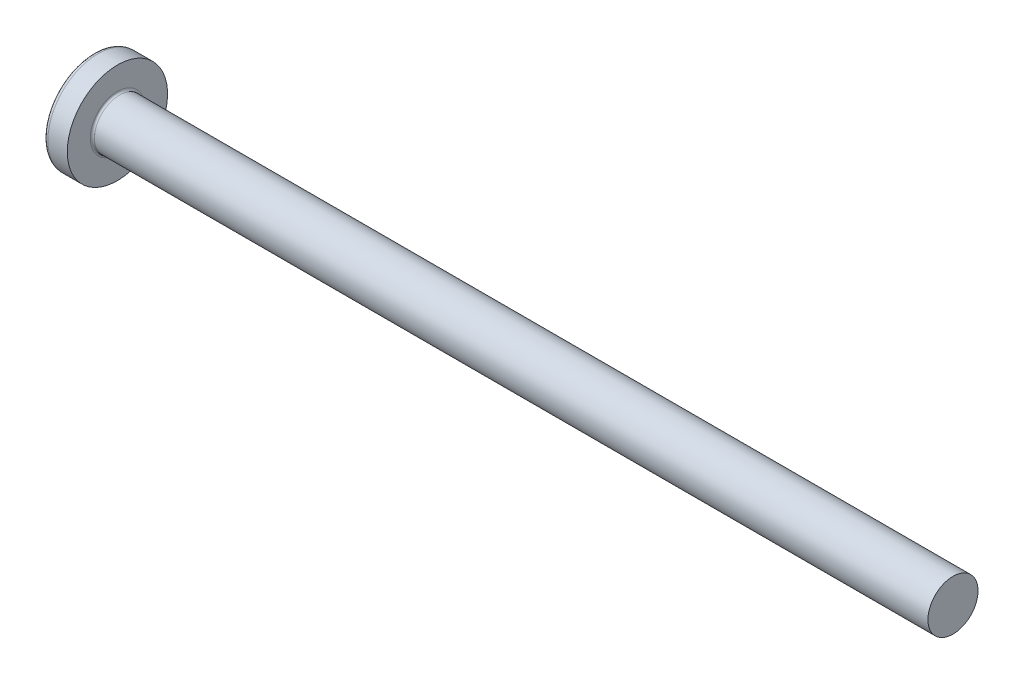
ISO-10303-21;
HEADER;
FILE_DESCRIPTION(('STEP AP214'),'2;1');
FILE_NAME('part.step','',(''),(''),'','','');
FILE_SCHEMA(('AUTOMOTIVE_DESIGN { 1 0 10303 214 1 1 1 1 }'));
ENDSEC;
DATA;
#1=APPLICATION_CONTEXT('core data for automotive mechanical design processes');
#2=APPLICATION_PROTOCOL_DEFINITION('international standard','automotive_design',2000,#1);
#3=PRODUCT_CONTEXT('',#1,'mechanical');
#4=PRODUCT('Part','Part','',(#3));
#5=PRODUCT_RELATED_PRODUCT_CATEGORY('part','',(#4));
#6=PRODUCT_DEFINITION_FORMATION('','',#4);
#7=PRODUCT_DEFINITION_CONTEXT('part definition',#1,'design');
#8=PRODUCT_DEFINITION('design','',#6,#7);
#9=PRODUCT_DEFINITION_SHAPE('','',#8);
#10=(LENGTH_UNIT() NAMED_UNIT(*) SI_UNIT(.MILLI.,.METRE.));
#11=(NAMED_UNIT(*) PLANE_ANGLE_UNIT() SI_UNIT($,.RADIAN.));
#12=(NAMED_UNIT(*) SI_UNIT($,.STERADIAN.) SOLID_ANGLE_UNIT());
#13=UNCERTAINTY_MEASURE_WITH_UNIT(LENGTH_MEASURE(1.E-05),#10,'distance_accuracy_value','');
#14=(GEOMETRIC_REPRESENTATION_CONTEXT(3) GLOBAL_UNCERTAINTY_ASSIGNED_CONTEXT((#13)) GLOBAL_UNIT_ASSIGNED_CONTEXT((#10,
#11,#12)) REPRESENTATION_CONTEXT('',''));
#15=CARTESIAN_POINT('',(0.,0.,0.));
#16=DIRECTION('',(0.,0.,1.));
#17=DIRECTION('',(1.,0.,0.));
#18=AXIS2_PLACEMENT_3D('',#15,#16,#17);
#19=CARTESIAN_POINT('',(10.,0.,0.));
#20=DIRECTION('',(-1.,0.,0.));
#21=DIRECTION('',(0.,1.,0.));
#22=AXIS2_PLACEMENT_3D('',#19,#20,#21);
#23=SPHERICAL_SURFACE('',#22,10.);
#24=CARTESIAN_POINT('',(1.83373872480847,0.,0.));
#25=DIRECTION('',(-1.,0.,0.));
#26=DIRECTION('',(0.,0.,1.));
#27=AXIS2_PLACEMENT_3D('',#24,#25,#26);
#28=CIRCLE('',#27,5.77167019027484);
#29=CARTESIAN_POINT('',(1.83373872480847,0.,5.77167019027484));
#30=VERTEX_POINT('',#29);
#31=EDGE_CURVE('E214',#30,#30,#28,.T.);
#32=ORIENTED_EDGE('',*,*,#31,.T.);
#33=EDGE_LOOP('',(#32));
#34=FACE_BOUND('',#33,.T.);
#35=CARTESIAN_POINT('',(0.11533271177369,0.,0.));
#36=DIRECTION('',(1.,0.,0.));
#37=DIRECTION('',(0.,0.,-1.));
#38=AXIS2_PLACEMENT_3D('',#35,#36,#37);
#39=CIRCLE('',#38,1.51438192047739);
#40=CARTESIAN_POINT('',(0.115332711773695,-0.709999999999995,-1.33762947076864));
#41=VERTEX_POINT('',#40);
#42=CARTESIAN_POINT('',(0.11533271177369,-1.33762947076862,-0.71));
#43=VERTEX_POINT('',#42);
#44=EDGE_CURVE('E341',#41,#43,#39,.F.);
#45=ORIENTED_EDGE('',*,*,#44,.F.);
#46=CARTESIAN_POINT('',(10.,-0.71,0.));
#47=DIRECTION('',(0.,1.,0.));
#48=DIRECTION('',(0.,0.,1.));
#49=AXIS2_PLACEMENT_3D('',#46,#47,#48);
#50=CIRCLE('',#49,9.97476315508293);
#51=CARTESIAN_POINT('',(0.516695966128057,-0.709999999999989,-3.09238493741451));
#52=VERTEX_POINT('',#51);
#53=EDGE_CURVE('E274',#52,#41,#50,.T.);
#54=ORIENTED_EDGE('',*,*,#53,.F.);
#55=CARTESIAN_POINT('',(9.3467899937754,0.,1.3101368059126));
#56=DIRECTION('',(0.446197753347436,0.,-0.894934391398443));
#57=DIRECTION('',(-0.894934391398443,0.,-0.446197753347436));
#58=AXIS2_PLACEMENT_3D('',#55,#56,#57);
#59=CIRCLE('',#58,9.89226254390578);
#60=CARTESIAN_POINT('',(0.516695966128057,0.710000000000011,-3.0923849374145));
#61=VERTEX_POINT('',#60);
#62=EDGE_CURVE('E248',#52,#61,#59,.T.);
#63=ORIENTED_EDGE('',*,*,#62,.T.);
#64=CARTESIAN_POINT('',(10.,0.71,0.));
#65=DIRECTION('',(0.,-1.,0.));
#66=DIRECTION('',(0.,0.,-1.));
#67=AXIS2_PLACEMENT_3D('',#64,#65,#66);
#68=CIRCLE('',#67,9.97476315508293);
#69=CARTESIAN_POINT('',(0.115332711773694,0.710000000000005,-1.33762947076863));
#70=VERTEX_POINT('',#69);
#71=EDGE_CURVE('E303',#70,#61,#68,.T.);
#72=ORIENTED_EDGE('',*,*,#71,.F.);
#73=CARTESIAN_POINT('',(0.11533271177369,1.33762947076862,-0.71));
#74=VERTEX_POINT('',#73);
#75=EDGE_CURVE('E356',#74,#70,#39,.F.);
#76=ORIENTED_EDGE('',*,*,#75,.F.);
#77=CARTESIAN_POINT('',(10.,0.,-0.71));
#78=DIRECTION('',(0.,0.,1.));
#79=DIRECTION('',(1.,0.,0.));
#80=AXIS2_PLACEMENT_3D('',#77,#78,#79);
#81=CIRCLE('',#80,9.97476315508293);
#82=CARTESIAN_POINT('',(0.516695966128057,3.09238493741451,-0.71));
#83=VERTEX_POINT('',#82);
#84=EDGE_CURVE('E242',#83,#74,#81,.T.);
#85=ORIENTED_EDGE('',*,*,#84,.F.);
#86=CARTESIAN_POINT('',(9.3467899937754,-1.3101368059126,0.));
#87=DIRECTION('',(0.446197753347436,0.894934391398443,0.));
#88=DIRECTION('',(-0.894934391398443,0.446197753347436,0.));
#89=AXIS2_PLACEMENT_3D('',#86,#87,#88);
#90=CIRCLE('',#89,9.89226254390578);
#91=CARTESIAN_POINT('',(0.516695966128057,3.09238493741451,0.71));
#92=VERTEX_POINT('',#91);
#93=EDGE_CURVE('E245',#83,#92,#90,.T.);
#94=ORIENTED_EDGE('',*,*,#93,.T.);
#95=CARTESIAN_POINT('',(10.,0.,0.71));
#96=DIRECTION('',(0.,0.,-1.));
#97=DIRECTION('',(0.,1.,0.));
#98=AXIS2_PLACEMENT_3D('',#95,#96,#97);
#99=CIRCLE('',#98,9.97476315508293);
#100=CARTESIAN_POINT('',(0.11533271177369,1.33762947076862,0.71));
#101=VERTEX_POINT('',#100);
#102=EDGE_CURVE('E238',#101,#92,#99,.T.);
#103=ORIENTED_EDGE('',*,*,#102,.F.);
#104=CARTESIAN_POINT('',(0.115332711773695,0.709999999999995,1.33762947076864));
#105=VERTEX_POINT('',#104);
#106=EDGE_CURVE('E355',#105,#101,#39,.F.);
#107=ORIENTED_EDGE('',*,*,#106,.F.);
#108=CARTESIAN_POINT('',(0.516695966128057,0.709999999999989,3.09238493741451));
#109=VERTEX_POINT('',#108);
#110=EDGE_CURVE('E258',#109,#105,#68,.T.);
#111=ORIENTED_EDGE('',*,*,#110,.F.);
#112=CARTESIAN_POINT('',(9.3467899937754,0.,-1.3101368059126));
#113=DIRECTION('',(0.446197753347436,0.,0.894934391398443));
#114=DIRECTION('',(0.894934391398443,0.,-0.446197753347436));
#115=AXIS2_PLACEMENT_3D('',#112,#113,#114);
#116=CIRCLE('',#115,9.89226254390578);
#117=CARTESIAN_POINT('',(0.516695966128057,-0.710000000000011,3.0923849374145));
#118=VERTEX_POINT('',#117);
#119=EDGE_CURVE('E49',#109,#118,#116,.T.);
#120=ORIENTED_EDGE('',*,*,#119,.T.);
#121=CARTESIAN_POINT('',(0.115332711773694,-0.710000000000005,1.33762947076863));
#122=VERTEX_POINT('',#121);
#123=EDGE_CURVE('E255',#122,#118,#50,.T.);
#124=ORIENTED_EDGE('',*,*,#123,.F.);
#125=CARTESIAN_POINT('',(0.11533271177369,-1.33762947076862,0.709999999999999));
#126=VERTEX_POINT('',#125);
#127=EDGE_CURVE('E391',#126,#122,#39,.F.);
#128=ORIENTED_EDGE('',*,*,#127,.F.);
#129=CARTESIAN_POINT('',(0.516695966128057,-3.0923849374145,0.709999999999999));
#130=VERTEX_POINT('',#129);
#131=EDGE_CURVE('E239',#130,#126,#99,.T.);
#132=ORIENTED_EDGE('',*,*,#131,.F.);
#133=CARTESIAN_POINT('',(9.3467899937754,1.3101368059126,0.));
#134=DIRECTION('',(0.446197753347436,-0.894934391398443,0.));
#135=DIRECTION('',(0.894934391398443,0.446197753347436,0.));
#136=AXIS2_PLACEMENT_3D('',#133,#134,#135);
#137=CIRCLE('',#136,9.89226254390578);
#138=CARTESIAN_POINT('',(0.516695966128057,-3.09238493741451,-0.71));
#139=VERTEX_POINT('',#138);
#140=EDGE_CURVE('E235',#130,#139,#137,.T.);
#141=ORIENTED_EDGE('',*,*,#140,.T.);
#142=EDGE_CURVE('E64',#43,#139,#81,.T.);
#143=ORIENTED_EDGE('',*,*,#142,.F.);
#144=EDGE_LOOP('',(#45,#54,#63,#72,#76,#85,#94,#103,#107,#111,#120,#124,#128,#132,#141,#143));
#145=FACE_BOUND('',#144,.T.);
#146=ADVANCED_FACE('F35',(#34,#145),#23,.T.);
#147=CARTESIAN_POINT('',(3.46,1.62490792462486,-0.71));
#148=DIRECTION('',(0.,0.,1.));
#149=DIRECTION('',(1.,0.,0.));
#150=AXIS2_PLACEMENT_3D('',#147,#148,#149);
#151=PLANE('',#150);
#152=ORIENTED_EDGE('',*,*,#84,.T.);
#153=CARTESIAN_POINT('',(-2.28089704213722,1.52473965101837,-0.71));
#154=CARTESIAN_POINT('',(-1.81861622822998,1.48907386498352,-0.71));
#155=CARTESIAN_POINT('',(-1.35635131302274,1.45320000395987,-0.71));
#156=CARTESIAN_POINT('',(-0.431857761667543,1.3808964085712,-0.71));
#157=CARTESIAN_POINT('',(0.0303708738054363,1.34446666558133,-0.71));
#158=CARTESIAN_POINT('',(0.954772750089382,1.27091270389059,-0.71));
#159=CARTESIAN_POINT('',(1.41694599093296,1.23378848560061,-0.71));
#160=CARTESIAN_POINT('',(2.1101468655661,1.17741958304234,-0.71));
#161=CARTESIAN_POINT('',(2.34120225142472,1.15851633138213,-0.71));
#162=CARTESIAN_POINT('',(2.80329254149198,1.12044387603508,-0.71));
#163=CARTESIAN_POINT('',(3.03432744556048,1.10127467065167,-0.71));
#164=CARTESIAN_POINT('',(3.81376951672291,1.03608826026628,-0.71));
#165=CARTESIAN_POINT('',(4.3621185642133,0.989367924506424,-0.71));
#166=CARTESIAN_POINT('',(5.18446393534975,0.917336183170652,-0.71));
#167=CARTESIAN_POINT('',(5.45854573527601,0.893000731200899,-0.71));
#168=CARTESIAN_POINT('',(6.00663594033703,0.843493254998865,-0.71));
#169=CARTESIAN_POINT('',(6.28064434495887,0.818321225066341,-0.71));
#170=CARTESIAN_POINT('',(6.82859287274618,0.766879824151132,-0.71));
#171=CARTESIAN_POINT('',(7.10253298312854,0.740610316661091,-0.71));
#172=CARTESIAN_POINT('',(7.65026285025565,0.686585019837831,-0.71));
#173=CARTESIAN_POINT('',(7.92405260972714,0.658829258423122,-0.71));
#174=CARTESIAN_POINT('',(8.33458184018721,0.615573696383427,-0.71));
#175=CARTESIAN_POINT('',(8.4714065534312,0.600884001267348,-0.71));
#176=CARTESIAN_POINT('',(8.74498055470476,0.570826220799602,-0.71));
#177=CARTESIAN_POINT('',(8.88172984329827,0.555458140591717,-0.71));
#178=CARTESIAN_POINT('',(9.15513948220117,0.523868434617907,-0.71));
#179=CARTESIAN_POINT('',(9.29179982631774,0.507646754763106,-0.71));
#180=CARTESIAN_POINT('',(9.56498051884117,0.474039680066355,-0.71));
#181=CARTESIAN_POINT('',(9.70150086350508,0.45665425489429,-0.71));
#182=CARTESIAN_POINT('',(9.83792645731126,0.438531836217977,-0.71));
#183=B_SPLINE_CURVE_WITH_KNOTS('',3,(#153,#154,#155,#156,#157,#158,#159,#160,#161,#162,#163,
#164,#165,#166,#167,#168,#169,#170,#171,#172,#173,#174,#175,#176,#177,#178,#179,#180,#181,#182),
.UNSPECIFIED.,.F.,.F.,(4,2,2,2,2,2,2,2,2,2,2,2,2,2,4),(0.,1.39096401174475,2.78194962715189,
4.17293441960638,4.86841633218882,5.56390268344286,7.21490482310267,8.04038405799492,
8.86586891866053,9.69145676295231,10.5170291044415,10.9298607906012,11.3426893470464,
11.7555440942062,12.1684096055867),.UNSPECIFIED.);
#184=CARTESIAN_POINT('',(3.46,1.06563607765503,-0.710000000000001));
#185=VERTEX_POINT('',#184);
#186=EDGE_CURVE('E378',#74,#185,#183,.T.);
#187=ORIENTED_EDGE('',*,*,#186,.T.);
#188=DIRECTION('',(0.,1.,0.));
#189=VECTOR('',#188,1.);
#190=CARTESIAN_POINT('',(3.46,-1.62490792462486,-0.71));
#191=LINE('',#190,#189);
#192=CARTESIAN_POINT('',(3.46,1.62490792462486,-0.71));
#193=VERTEX_POINT('',#192);
#194=EDGE_CURVE('E324',#185,#193,#191,.T.);
#195=ORIENTED_EDGE('',*,*,#194,.T.);
#196=DIRECTION('',(0.894934391398442,-0.446197753347436,0.));
#197=VECTOR('',#196,1.);
#198=CARTESIAN_POINT('',(0.,3.35,-0.71));
#199=LINE('',#198,#197);
#200=EDGE_CURVE('E215',#83,#193,#199,.T.);
#201=ORIENTED_EDGE('',*,*,#200,.F.);
#202=EDGE_LOOP('',(#152,#187,#195,#201));
#203=FACE_BOUND('',#202,.T.);
#204=ADVANCED_FACE('F170',(#203),#151,.T.);
#205=CARTESIAN_POINT('',(3.46,-1.62490792462486,-0.71));
#206=VERTEX_POINT('',#205);
#207=CARTESIAN_POINT('',(3.46,-1.06563607765503,-0.710000000000001));
#208=VERTEX_POINT('',#207);
#209=EDGE_CURVE('E223',#206,#208,#191,.T.);
#210=ORIENTED_EDGE('',*,*,#209,.T.);
#211=CARTESIAN_POINT('',(-2.28089704213722,-1.52473965101837,-0.71));
#212=CARTESIAN_POINT('',(-1.81861622822998,-1.48907386498352,-0.71));
#213=CARTESIAN_POINT('',(-1.35635131302274,-1.45320000395987,-0.71));
#214=CARTESIAN_POINT('',(-0.431857761667543,-1.3808964085712,-0.71));
#215=CARTESIAN_POINT('',(0.0303708738054364,-1.34446666558133,-0.71));
#216=CARTESIAN_POINT('',(0.954772750089383,-1.27091270389059,-0.71));
#217=CARTESIAN_POINT('',(1.41694599093296,-1.23378848560061,-0.71));
#218=CARTESIAN_POINT('',(2.1101468655661,-1.17741958304234,-0.71));
#219=CARTESIAN_POINT('',(2.34120225142472,-1.15851633138213,-0.71));
#220=CARTESIAN_POINT('',(2.80329254149198,-1.12044387603508,-0.71));
#221=CARTESIAN_POINT('',(3.03432744556048,-1.10127467065167,-0.71));
#222=CARTESIAN_POINT('',(3.81376951672291,-1.03608826026628,-0.71));
#223=CARTESIAN_POINT('',(4.3621185642133,-0.989367924506424,-0.71));
#224=CARTESIAN_POINT('',(5.18446393534975,-0.917336183170652,-0.71));
#225=CARTESIAN_POINT('',(5.45854573527601,-0.893000731200899,-0.71));
#226=CARTESIAN_POINT('',(6.00663594033703,-0.843493254998865,-0.71));
#227=CARTESIAN_POINT('',(6.28064434495887,-0.818321225066341,-0.71));
#228=CARTESIAN_POINT('',(6.82859287274618,-0.766879824151132,-0.71));
#229=CARTESIAN_POINT('',(7.10253298312854,-0.740610316661091,-0.71));
#230=CARTESIAN_POINT('',(7.65026285025565,-0.686585019837831,-0.71));
#231=CARTESIAN_POINT('',(7.92405260972714,-0.658829258423122,-0.71));
#232=CARTESIAN_POINT('',(8.33458184018721,-0.615573696383427,-0.71));
#233=CARTESIAN_POINT('',(8.4714065534312,-0.600884001267348,-0.71));
#234=CARTESIAN_POINT('',(8.74498055470476,-0.570826220799602,-0.71));
#235=CARTESIAN_POINT('',(8.88172984329826,-0.555458140591717,-0.71));
#236=CARTESIAN_POINT('',(9.15513948220117,-0.523868434617907,-0.71));
#237=CARTESIAN_POINT('',(9.29179982631774,-0.507646754763106,-0.71));
#238=CARTESIAN_POINT('',(9.56498051884117,-0.474039680066355,-0.71));
#239=CARTESIAN_POINT('',(9.70150086350508,-0.456654254894289,-0.71));
#240=CARTESIAN_POINT('',(9.83792645731126,-0.438531836217976,-0.71));
#241=B_SPLINE_CURVE_WITH_KNOTS('',3,(#211,#212,#213,#214,#215,#216,#217,#218,#219,#220,#221,
#222,#223,#224,#225,#226,#227,#228,#229,#230,#231,#232,#233,#234,#235,#236,#237,#238,#239,#240),
.UNSPECIFIED.,.F.,.F.,(4,2,2,2,2,2,2,2,2,2,2,2,2,2,4),(0.,1.39096401174475,2.78194962715189,
4.17293441960638,4.86841633218882,5.56390268344286,7.21490482310267,8.04038405799492,
8.86586891866053,9.69145676295231,10.5170291044415,10.9298607906012,11.3426893470464,
11.7555440942062,12.1684096055867),.UNSPECIFIED.);
#242=EDGE_CURVE('E354',#208,#43,#241,.F.);
#243=ORIENTED_EDGE('',*,*,#242,.T.);
#244=ORIENTED_EDGE('',*,*,#142,.T.);
#245=DIRECTION('',(0.894934391398442,0.446197753347436,0.));
#246=VECTOR('',#245,1.);
#247=CARTESIAN_POINT('',(0.,-3.35,-0.71));
#248=LINE('',#247,#246);
#249=EDGE_CURVE('E306',#139,#206,#248,.T.);
#250=ORIENTED_EDGE('',*,*,#249,.T.);
#251=EDGE_LOOP('',(#210,#243,#244,#250));
#252=FACE_BOUND('',#251,.T.);
#253=ADVANCED_FACE('F176',(#252),#151,.T.);
#254=CARTESIAN_POINT('',(3.46,-1.62490792462486,0.71));
#255=DIRECTION('',(0.,0.,-1.));
#256=DIRECTION('',(0.,1.,0.));
#257=AXIS2_PLACEMENT_3D('',#254,#255,#256);
#258=PLANE('',#257);
#259=DIRECTION('',(0.,-1.,0.));
#260=VECTOR('',#259,1.);
#261=CARTESIAN_POINT('',(3.46,1.62490792462486,0.71));
#262=LINE('',#261,#260);
#263=CARTESIAN_POINT('',(3.46,1.62490792462486,0.71));
#264=VERTEX_POINT('',#263);
#265=CARTESIAN_POINT('',(3.46,1.06563607765503,0.710000000000001));
#266=VERTEX_POINT('',#265);
#267=EDGE_CURVE('E314',#264,#266,#262,.T.);
#268=ORIENTED_EDGE('',*,*,#267,.T.);
#269=CARTESIAN_POINT('',(-2.28089705027091,1.52473965164577,0.71));
#270=CARTESIAN_POINT('',(-1.81861623532717,1.48907386553353,0.71));
#271=CARTESIAN_POINT('',(-1.35635131908348,1.45320000443187,0.71));
#272=CARTESIAN_POINT('',(-0.431857765655442,1.38089640888514,0.71));
#273=CARTESIAN_POINT('',(0.0303708708539246,1.3444666658152,0.71));
#274=CARTESIAN_POINT('',(0.954772749881989,1.27091270390807,0.71));
#275=CARTESIAN_POINT('',(1.41694599243322,1.23378848548075,0.71));
#276=CARTESIAN_POINT('',(2.11014686962733,1.17741958271103,0.71));
#277=CARTESIAN_POINT('',(2.3412022563395,1.15851633097942,0.71));
#278=CARTESIAN_POINT('',(2.80329254811369,1.12044387548729,0.71));
#279=CARTESIAN_POINT('',(3.03432745303557,1.10127467003019,0.71));
#280=CARTESIAN_POINT('',(3.8137695250509,1.03608825956087,0.71));
#281=CARTESIAN_POINT('',(4.36211857254078,0.989367923790553,0.71));
#282=CARTESIAN_POINT('',(5.18446394367596,0.917336182434635,0.71));
#283=CARTESIAN_POINT('',(5.45854574360168,0.893000730457427,0.71));
#284=CARTESIAN_POINT('',(6.00663594866142,0.843493254238334,0.71));
#285=CARTESIAN_POINT('',(6.28064435328252,0.818321224296205,0.71));
#286=CARTESIAN_POINT('',(6.82859288106827,0.766879823358567,0.71));
#287=CARTESIAN_POINT('',(7.1025329914498,0.7406103158557,0.71));
#288=CARTESIAN_POINT('',(7.65026285857465,0.686585019001786,0.71));
#289=CARTESIAN_POINT('',(7.92405261804469,0.658829257569248,0.71));
#290=CARTESIAN_POINT('',(8.3345818485019,0.61557369549618,0.71));
#291=CARTESIAN_POINT('',(8.47140656174489,0.600884000367865,0.71));
#292=CARTESIAN_POINT('',(8.74498056301602,0.570826219872502,0.71));
#293=CARTESIAN_POINT('',(8.8817298516081,0.555458139649238,0.71));
#294=CARTESIAN_POINT('',(9.15513949050765,0.523868433640255,0.71));
#295=CARTESIAN_POINT('',(9.29179983462227,0.50764675376566,0.71));
#296=CARTESIAN_POINT('',(9.56498052714077,0.474039679022048,0.71));
#297=CARTESIAN_POINT('',(9.70150087180168,0.456654253822914,0.71));
#298=CARTESIAN_POINT('',(9.83792646560407,0.438531835114465,0.71));
#299=B_SPLINE_CURVE_WITH_KNOTS('',3,(#269,#270,#271,#272,#273,#274,#275,#276,#277,#278,#279,
#280,#281,#282,#283,#284,#285,#286,#287,#288,#289,#290,#291,#292,#293,#294,#295,#296,#297,#298),
.UNSPECIFIED.,.F.,.F.,(4,2,2,2,2,2,2,2,2,2,2,2,2,2,4),(0.,1.39096401486289,2.78194963338846,
4.17293443098243,4.86841634613445,5.56390269995814,7.21490483961907,8.04038407451168,
8.86586893517771,9.69145677947068,10.5170291209609,10.9298608071215,11.3426893635676,
11.7555441107285,12.1684096221104),.UNSPECIFIED.);
#300=EDGE_CURVE('E279',#266,#101,#299,.F.);
#301=ORIENTED_EDGE('',*,*,#300,.T.);
#302=ORIENTED_EDGE('',*,*,#102,.T.);
#303=DIRECTION('',(0.894934391398442,-0.446197753347436,0.));
#304=VECTOR('',#303,1.);
#305=CARTESIAN_POINT('',(0.,3.35,0.71));
#306=LINE('',#305,#304);
#307=EDGE_CURVE('E220',#92,#264,#306,.T.);
#308=ORIENTED_EDGE('',*,*,#307,.T.);
#309=EDGE_LOOP('',(#268,#301,#302,#308));
#310=FACE_BOUND('',#309,.T.);
#311=ADVANCED_FACE('F374',(#310),#258,.T.);
#312=ORIENTED_EDGE('',*,*,#131,.T.);
#313=CARTESIAN_POINT('',(-2.28089704213722,-1.52473965101837,0.71));
#314=CARTESIAN_POINT('',(-1.81861622822998,-1.48907386498352,0.71));
#315=CARTESIAN_POINT('',(-1.35635131302274,-1.45320000395987,0.71));
#316=CARTESIAN_POINT('',(-0.431857761667543,-1.3808964085712,0.71));
#317=CARTESIAN_POINT('',(0.0303708738054362,-1.34446666558133,0.71));
#318=CARTESIAN_POINT('',(0.954772750089382,-1.27091270389059,0.71));
#319=CARTESIAN_POINT('',(1.41694599093296,-1.23378848560061,0.71));
#320=CARTESIAN_POINT('',(2.1101468655661,-1.17741958304234,0.71));
#321=CARTESIAN_POINT('',(2.34120225142472,-1.15851633138213,0.71));
#322=CARTESIAN_POINT('',(2.80329254149198,-1.12044387603508,0.71));
#323=CARTESIAN_POINT('',(3.03432744556048,-1.10127467065167,0.71));
#324=CARTESIAN_POINT('',(3.81376951672291,-1.03608826026628,0.71));
#325=CARTESIAN_POINT('',(4.3621185642133,-0.989367924506424,0.71));
#326=CARTESIAN_POINT('',(5.18446393534975,-0.917336183170652,0.71));
#327=CARTESIAN_POINT('',(5.45854573527601,-0.893000731200899,0.71));
#328=CARTESIAN_POINT('',(6.00663594033703,-0.843493254998865,0.71));
#329=CARTESIAN_POINT('',(6.28064434495887,-0.818321225066341,0.71));
#330=CARTESIAN_POINT('',(6.82859287274618,-0.766879824151132,0.71));
#331=CARTESIAN_POINT('',(7.10253298312854,-0.740610316661091,0.71));
#332=CARTESIAN_POINT('',(7.65026285025566,-0.686585019837831,0.71));
#333=CARTESIAN_POINT('',(7.92405260972714,-0.658829258423122,0.71));
#334=CARTESIAN_POINT('',(8.33458184018721,-0.615573696383427,0.71));
#335=CARTESIAN_POINT('',(8.4714065534312,-0.600884001267348,0.71));
#336=CARTESIAN_POINT('',(8.74498055470476,-0.570826220799602,0.71));
#337=CARTESIAN_POINT('',(8.88172984329826,-0.555458140591717,0.71));
#338=CARTESIAN_POINT('',(9.15513948220117,-0.523868434617907,0.71));
#339=CARTESIAN_POINT('',(9.29179982631774,-0.507646754763106,0.71));
#340=CARTESIAN_POINT('',(9.56498051884117,-0.474039680066355,0.71));
#341=CARTESIAN_POINT('',(9.70150086350508,-0.456654254894289,0.71));
#342=CARTESIAN_POINT('',(9.83792645731126,-0.438531836217976,0.71));
#343=B_SPLINE_CURVE_WITH_KNOTS('',3,(#313,#314,#315,#316,#317,#318,#319,#320,#321,#322,#323,
#324,#325,#326,#327,#328,#329,#330,#331,#332,#333,#334,#335,#336,#337,#338,#339,#340,#341,#342),
.UNSPECIFIED.,.F.,.F.,(4,2,2,2,2,2,2,2,2,2,2,2,2,2,4),(0.,1.39096401174475,2.78194962715189,
4.17293441960638,4.86841633218882,5.56390268344286,7.21490482310267,8.04038405799493,
8.86586891866053,9.69145676295231,10.5170291044415,10.9298607906012,11.3426893470464,
11.7555440942062,12.1684096055867),.UNSPECIFIED.);
#344=CARTESIAN_POINT('',(3.46,-1.06563607765503,0.710000000000001));
#345=VERTEX_POINT('',#344);
#346=EDGE_CURVE('E392',#126,#345,#343,.T.);
#347=ORIENTED_EDGE('',*,*,#346,.T.);
#348=CARTESIAN_POINT('',(3.46,-1.62490792462486,0.71));
#349=VERTEX_POINT('',#348);
#350=EDGE_CURVE('E316',#345,#349,#262,.T.);
#351=ORIENTED_EDGE('',*,*,#350,.T.);
#352=DIRECTION('',(0.894934391398442,0.446197753347436,0.));
#353=VECTOR('',#352,1.);
#354=CARTESIAN_POINT('',(0.,-3.35,0.709999999999999));
#355=LINE('',#354,#353);
#356=EDGE_CURVE('E308',#130,#349,#355,.T.);
#357=ORIENTED_EDGE('',*,*,#356,.F.);
#358=EDGE_LOOP('',(#312,#347,#351,#357));
#359=FACE_BOUND('',#358,.T.);
#360=ADVANCED_FACE('F422',(#359),#258,.T.);
#361=CARTESIAN_POINT('',(3.46,1.62490792462486,-0.709999999999999));
#362=DIRECTION('',(-1.,0.,0.));
#363=DIRECTION('',(0.,0.,1.));
#364=AXIS2_PLACEMENT_3D('',#361,#362,#363);
#365=PLANE('',#364);
#366=ORIENTED_EDGE('',*,*,#350,.F.);
#367=CARTESIAN_POINT('',(3.46,0.,0.));
#368=DIRECTION('',(-1.,0.,0.));
#369=DIRECTION('',(0.,0.,1.));
#370=AXIS2_PLACEMENT_3D('',#367,#368,#369);
#371=CIRCLE('',#370,1.2805);
#372=EDGE_CURVE('E349',#208,#345,#371,.T.);
#373=ORIENTED_EDGE('',*,*,#372,.F.);
#374=ORIENTED_EDGE('',*,*,#209,.F.);
#375=DIRECTION('',(0.,0.,1.));
#376=VECTOR('',#375,1.);
#377=CARTESIAN_POINT('',(3.46,-1.62490792462486,-0.71));
#378=LINE('',#377,#376);
#379=EDGE_CURVE('E311',#206,#349,#378,.T.);
#380=ORIENTED_EDGE('',*,*,#379,.T.);
#381=EDGE_LOOP('',(#366,#373,#374,#380));
#382=FACE_BOUND('',#381,.T.);
#383=ADVANCED_FACE('F415',(#382),#365,.T.);
#384=DIRECTION('',(0.,0.,-1.));
#385=VECTOR('',#384,1.);
#386=CARTESIAN_POINT('',(3.46,-0.710000000000006,1.62490792462486));
#387=LINE('',#386,#385);
#388=CARTESIAN_POINT('',(3.46,-0.709999999999996,-1.06563607765503));
#389=VERTEX_POINT('',#388);
#390=CARTESIAN_POINT('',(3.46,-0.709999999999994,-1.62490792462486));
#391=VERTEX_POINT('',#390);
#392=EDGE_CURVE('E297',#389,#391,#387,.T.);
#393=ORIENTED_EDGE('',*,*,#392,.F.);
#394=CARTESIAN_POINT('',(3.46,0.710000000000004,-1.06563607765503));
#395=VERTEX_POINT('',#394);
#396=EDGE_CURVE('E56',#395,#389,#371,.T.);
#397=ORIENTED_EDGE('',*,*,#396,.F.);
#398=DIRECTION('',(0.,0.,1.));
#399=VECTOR('',#398,1.);
#400=CARTESIAN_POINT('',(3.46,0.710000000000006,-1.62490792462486));
#401=LINE('',#400,#399);
#402=CARTESIAN_POINT('',(3.46,0.710000000000006,-1.62490792462486));
#403=VERTEX_POINT('',#402);
#404=EDGE_CURVE('E300',#403,#395,#401,.T.);
#405=ORIENTED_EDGE('',*,*,#404,.F.);
#406=DIRECTION('',(0.,-1.,0.));
#407=VECTOR('',#406,1.);
#408=CARTESIAN_POINT('',(3.46,0.710000000000006,-1.62490792462486));
#409=LINE('',#408,#407);
#410=EDGE_CURVE('E291',#403,#391,#409,.T.);
#411=ORIENTED_EDGE('',*,*,#410,.T.);
#412=EDGE_LOOP('',(#393,#397,#405,#411));
#413=FACE_BOUND('',#412,.T.);
#414=ADVANCED_FACE('F344',(#413),#365,.T.);
#415=ORIENTED_EDGE('',*,*,#194,.F.);
#416=EDGE_CURVE('E348',#266,#185,#371,.T.);
#417=ORIENTED_EDGE('',*,*,#416,.F.);
#418=ORIENTED_EDGE('',*,*,#267,.F.);
#419=DIRECTION('',(0.,0.,-1.));
#420=VECTOR('',#419,1.);
#421=CARTESIAN_POINT('',(3.46,1.62490792462486,0.71));
#422=LINE('',#421,#420);
#423=EDGE_CURVE('E317',#264,#193,#422,.T.);
#424=ORIENTED_EDGE('',*,*,#423,.T.);
#425=EDGE_LOOP('',(#415,#417,#418,#424));
#426=FACE_BOUND('',#425,.T.);
#427=ADVANCED_FACE('F416',(#426),#365,.T.);
#428=CARTESIAN_POINT('',(3.46,0.709999999999994,1.62490792462486));
#429=DIRECTION('',(0.,-1.,0.));
#430=DIRECTION('',(1.,0.,0.));
#431=AXIS2_PLACEMENT_3D('',#428,#429,#430);
#432=PLANE('',#431);
#433=ORIENTED_EDGE('',*,*,#110,.T.);
#434=CARTESIAN_POINT('',(-2.28089704213722,0.709999999999995,1.52473965101837));
#435=CARTESIAN_POINT('',(-1.81861622822998,0.709999999999995,1.48907386498352));
#436=CARTESIAN_POINT('',(-1.35635131302274,0.709999999999995,1.45320000395987));
#437=CARTESIAN_POINT('',(-0.431857761667543,0.709999999999995,1.38089640857121));
#438=CARTESIAN_POINT('',(0.0303708738054362,0.709999999999995,1.34446666558134));
#439=CARTESIAN_POINT('',(0.954772750089383,0.709999999999995,1.2709127038906));
#440=CARTESIAN_POINT('',(1.41694599093296,0.709999999999996,1.23378848560061));
#441=CARTESIAN_POINT('',(2.1101468655661,0.709999999999996,1.17741958304234));
#442=CARTESIAN_POINT('',(2.34120225142472,0.709999999999996,1.15851633138213));
#443=CARTESIAN_POINT('',(2.80329254149198,0.709999999999996,1.12044387603508));
#444=CARTESIAN_POINT('',(3.03432744556048,0.709999999999996,1.10127467065167));
#445=CARTESIAN_POINT('',(3.81376951672291,0.709999999999996,1.03608826026628));
#446=CARTESIAN_POINT('',(4.3621185642133,0.709999999999997,0.989367924506427));
#447=CARTESIAN_POINT('',(5.18446393534975,0.709999999999997,0.917336183170655));
#448=CARTESIAN_POINT('',(5.45854573527601,0.709999999999997,0.893000731200901));
#449=CARTESIAN_POINT('',(6.00663594033703,0.709999999999997,0.843493254998868));
#450=CARTESIAN_POINT('',(6.28064434495887,0.709999999999997,0.818321225066344));
#451=CARTESIAN_POINT('',(6.82859287274618,0.709999999999997,0.766879824151135));
#452=CARTESIAN_POINT('',(7.10253298312854,0.709999999999997,0.740610316661093));
#453=CARTESIAN_POINT('',(7.65026285025565,0.709999999999998,0.686585019837834));
#454=CARTESIAN_POINT('',(7.92405260972714,0.709999999999998,0.658829258423125));
#455=CARTESIAN_POINT('',(8.33458184018721,0.709999999999998,0.615573696383429));
#456=CARTESIAN_POINT('',(8.4714065534312,0.709999999999998,0.600884001267351));
#457=CARTESIAN_POINT('',(8.74498055470475,0.709999999999998,0.570826220799605));
#458=CARTESIAN_POINT('',(8.88172984329826,0.709999999999998,0.55545814059172));
#459=CARTESIAN_POINT('',(9.15513948220117,0.709999999999998,0.52386843461791));
#460=CARTESIAN_POINT('',(9.29179982631774,0.709999999999998,0.507646754763109));
#461=CARTESIAN_POINT('',(9.56498051884117,0.709999999999998,0.474039680066358));
#462=CARTESIAN_POINT('',(9.70150086350508,0.709999999999998,0.456654254894292));
#463=CARTESIAN_POINT('',(9.83792645731126,0.709999999999998,0.438531836217979));
#464=B_SPLINE_CURVE_WITH_KNOTS('',3,(#434,#435,#436,#437,#438,#439,#440,#441,#442,#443,#444,
#445,#446,#447,#448,#449,#450,#451,#452,#453,#454,#455,#456,#457,#458,#459,#460,#461,#462,#463),
.UNSPECIFIED.,.F.,.F.,(4,2,2,2,2,2,2,2,2,2,2,2,2,2,4),(0.,1.39096401174475,2.78194962715189,
4.17293441960638,4.86841633218882,5.56390268344286,7.21490482310267,8.04038405799492,
8.86586891866053,9.6914567629523,10.5170291044415,10.9298607906012,11.3426893470464,
11.7555440942062,12.1684096055867),.UNSPECIFIED.);
#465=CARTESIAN_POINT('',(3.46,0.709999999999996,1.06563607765503));
#466=VERTEX_POINT('',#465);
#467=EDGE_CURVE('E440',#105,#466,#464,.T.);
#468=ORIENTED_EDGE('',*,*,#467,.T.);
#469=CARTESIAN_POINT('',(3.46,0.709999999999994,1.62490792462486));
#470=VERTEX_POINT('',#469);
#471=EDGE_CURVE('E272',#466,#470,#401,.T.);
#472=ORIENTED_EDGE('',*,*,#471,.T.);
#473=DIRECTION('',(0.894934391398442,0.,-0.446197753347436));
#474=VECTOR('',#473,1.);
#475=CARTESIAN_POINT('',(0.,0.709999999999988,3.35));
#476=LINE('',#475,#474);
#477=EDGE_CURVE('E265',#109,#470,#476,.T.);
#478=ORIENTED_EDGE('',*,*,#477,.F.);
#479=EDGE_LOOP('',(#433,#468,#472,#478));
#480=FACE_BOUND('',#479,.T.);
#481=ADVANCED_FACE('F269',(#480),#432,.T.);
#482=CARTESIAN_POINT('',(3.46,-0.709999999999994,-1.62490792462486));
#483=DIRECTION('',(0.,1.,0.));
#484=DIRECTION('',(0.,0.,1.));
#485=AXIS2_PLACEMENT_3D('',#482,#483,#484);
#486=PLANE('',#485);
#487=CARTESIAN_POINT('',(3.46,-0.710000000000006,1.62490792462486));
#488=VERTEX_POINT('',#487);
#489=CARTESIAN_POINT('',(3.46,-0.710000000000004,1.06563607765503));
#490=VERTEX_POINT('',#489);
#491=EDGE_CURVE('E294',#488,#490,#387,.T.);
#492=ORIENTED_EDGE('',*,*,#491,.T.);
#493=CARTESIAN_POINT('',(-2.28089705027091,-0.710000000000005,1.52473965164577));
#494=CARTESIAN_POINT('',(-1.81861623532717,-0.710000000000005,1.48907386553353));
#495=CARTESIAN_POINT('',(-1.35635131908348,-0.710000000000005,1.45320000443187));
#496=CARTESIAN_POINT('',(-0.431857765655443,-0.710000000000005,1.38089640888513));
#497=CARTESIAN_POINT('',(0.030370870853924,-0.710000000000005,1.3444666658152));
#498=CARTESIAN_POINT('',(0.954772749881989,-0.710000000000004,1.27091270390807));
#499=CARTESIAN_POINT('',(1.41694599243322,-0.710000000000004,1.23378848548075));
#500=CARTESIAN_POINT('',(2.11014686962733,-0.710000000000004,1.17741958271102));
#501=CARTESIAN_POINT('',(2.3412022563395,-0.710000000000004,1.15851633097942));
#502=CARTESIAN_POINT('',(2.80329254811369,-0.710000000000004,1.12044387548729));
#503=CARTESIAN_POINT('',(3.03432745303557,-0.710000000000004,1.10127467003019));
#504=CARTESIAN_POINT('',(3.81376952505089,-0.710000000000004,1.03608825956087));
#505=CARTESIAN_POINT('',(4.36211857254078,-0.710000000000004,0.989367923790551));
#506=CARTESIAN_POINT('',(5.18446394367596,-0.710000000000003,0.917336182434633));
#507=CARTESIAN_POINT('',(5.45854574360167,-0.710000000000003,0.893000730457425));
#508=CARTESIAN_POINT('',(6.00663594866141,-0.710000000000003,0.843493254238332));
#509=CARTESIAN_POINT('',(6.28064435328251,-0.710000000000003,0.818321224296203));
#510=CARTESIAN_POINT('',(6.82859288106826,-0.710000000000003,0.766879823358565));
#511=CARTESIAN_POINT('',(7.1025329914498,-0.710000000000003,0.740610315855698));
#512=CARTESIAN_POINT('',(7.65026285857464,-0.710000000000003,0.686585019001784));
#513=CARTESIAN_POINT('',(7.92405261804469,-0.710000000000003,0.658829257569246));
#514=CARTESIAN_POINT('',(8.33458184850189,-0.710000000000002,0.615573695496179));
#515=CARTESIAN_POINT('',(8.47140656174489,-0.710000000000002,0.600884000367863));
#516=CARTESIAN_POINT('',(8.74498056301602,-0.710000000000002,0.5708262198725));
#517=CARTESIAN_POINT('',(8.8817298516081,-0.710000000000002,0.555458139649236));
#518=CARTESIAN_POINT('',(9.15513949050764,-0.710000000000002,0.523868433640253));
#519=CARTESIAN_POINT('',(9.29179983462226,-0.710000000000002,0.507646753765658));
#520=CARTESIAN_POINT('',(9.56498052714076,-0.710000000000002,0.474039679022046));
#521=CARTESIAN_POINT('',(9.70150087180168,-0.710000000000002,0.456654253822912));
#522=CARTESIAN_POINT('',(9.83792646560407,-0.710000000000002,0.438531835114463));
#523=B_SPLINE_CURVE_WITH_KNOTS('',3,(#493,#494,#495,#496,#497,#498,#499,#500,#501,#502,#503,
#504,#505,#506,#507,#508,#509,#510,#511,#512,#513,#514,#515,#516,#517,#518,#519,#520,#521,#522),
.UNSPECIFIED.,.F.,.F.,(4,2,2,2,2,2,2,2,2,2,2,2,2,2,4),(0.,1.39096401486289,2.78194963338846,
4.17293443098243,4.86841634613445,5.56390269995814,7.21490483961907,8.04038407451168,
8.8658689351777,9.69145677947067,10.5170291209609,10.9298608071215,11.3426893635676,
11.7555441107285,12.1684096221104),.UNSPECIFIED.);
#524=EDGE_CURVE('E384',#490,#122,#523,.F.);
#525=ORIENTED_EDGE('',*,*,#524,.T.);
#526=ORIENTED_EDGE('',*,*,#123,.T.);
#527=DIRECTION('',(0.894934391398442,0.,-0.446197753347436));
#528=VECTOR('',#527,1.);
#529=CARTESIAN_POINT('',(0.,-0.710000000000012,3.35));
#530=LINE('',#529,#528);
#531=EDGE_CURVE('E267',#118,#488,#530,.T.);
#532=ORIENTED_EDGE('',*,*,#531,.T.);
#533=EDGE_LOOP('',(#492,#525,#526,#532));
#534=FACE_BOUND('',#533,.T.);
#535=ADVANCED_FACE('F205',(#534),#486,.T.);
#536=ORIENTED_EDGE('',*,*,#404,.T.);
#537=CARTESIAN_POINT('',(-2.28089704213722,0.710000000000005,-1.52473965101837));
#538=CARTESIAN_POINT('',(-1.81861622822998,0.710000000000005,-1.48907386498351));
#539=CARTESIAN_POINT('',(-1.35635131302274,0.710000000000005,-1.45320000395987));
#540=CARTESIAN_POINT('',(-0.431857761667543,0.710000000000005,-1.3808964085712));
#541=CARTESIAN_POINT('',(0.0303708738054363,0.710000000000005,-1.34446666558133));
#542=CARTESIAN_POINT('',(0.954772750089382,0.710000000000004,-1.27091270389059));
#543=CARTESIAN_POINT('',(1.41694599093296,0.710000000000004,-1.23378848560061));
#544=CARTESIAN_POINT('',(2.1101468655661,0.710000000000004,-1.17741958304234));
#545=CARTESIAN_POINT('',(2.34120225142472,0.710000000000004,-1.15851633138212));
#546=CARTESIAN_POINT('',(2.80329254149198,0.710000000000004,-1.12044387603508));
#547=CARTESIAN_POINT('',(3.03432744556048,0.710000000000004,-1.10127467065166));
#548=CARTESIAN_POINT('',(3.81376951672291,0.710000000000004,-1.03608826026627));
#549=CARTESIAN_POINT('',(4.3621185642133,0.710000000000004,-0.989367924506422));
#550=CARTESIAN_POINT('',(5.18446393534975,0.710000000000003,-0.91733618317065));
#551=CARTESIAN_POINT('',(5.45854573527601,0.710000000000003,-0.893000731200896));
#552=CARTESIAN_POINT('',(6.00663594033703,0.710000000000003,-0.843493254998863));
#553=CARTESIAN_POINT('',(6.28064434495887,0.710000000000003,-0.818321225066339));
#554=CARTESIAN_POINT('',(6.82859287274618,0.710000000000003,-0.76687982415113));
#555=CARTESIAN_POINT('',(7.10253298312854,0.710000000000003,-0.740610316661088));
#556=CARTESIAN_POINT('',(7.65026285025565,0.710000000000002,-0.686585019837829));
#557=CARTESIAN_POINT('',(7.92405260972714,0.710000000000002,-0.65882925842312));
#558=CARTESIAN_POINT('',(8.33458184018721,0.710000000000002,-0.615573696383424));
#559=CARTESIAN_POINT('',(8.4714065534312,0.710000000000002,-0.600884001267345));
#560=CARTESIAN_POINT('',(8.74498055470476,0.710000000000002,-0.5708262207996));
#561=CARTESIAN_POINT('',(8.88172984329827,0.710000000000002,-0.555458140591715));
#562=CARTESIAN_POINT('',(9.15513948220117,0.710000000000002,-0.523868434617905));
#563=CARTESIAN_POINT('',(9.29179982631774,0.710000000000002,-0.507646754763103));
#564=CARTESIAN_POINT('',(9.56498051884117,0.710000000000002,-0.474039680066353));
#565=CARTESIAN_POINT('',(9.70150086350508,0.710000000000001,-0.456654254894287));
#566=CARTESIAN_POINT('',(9.83792645731126,0.710000000000001,-0.438531836217974));
#567=B_SPLINE_CURVE_WITH_KNOTS('',3,(#537,#538,#539,#540,#541,#542,#543,#544,#545,#546,#547,
#548,#549,#550,#551,#552,#553,#554,#555,#556,#557,#558,#559,#560,#561,#562,#563,#564,#565,#566),
.UNSPECIFIED.,.F.,.F.,(4,2,2,2,2,2,2,2,2,2,2,2,2,2,4),(0.,1.39096401174475,2.78194962715189,
4.17293441960638,4.86841633218882,5.56390268344286,7.21490482310267,8.04038405799492,
8.86586891866053,9.69145676295231,10.5170291044415,10.9298607906012,11.3426893470464,
11.7555440942062,12.1684096055867),.UNSPECIFIED.);
#568=EDGE_CURVE('E333',#395,#70,#567,.F.);
#569=ORIENTED_EDGE('',*,*,#568,.T.);
#570=ORIENTED_EDGE('',*,*,#71,.T.);
#571=DIRECTION('',(0.894934391398442,0.,0.446197753347436));
#572=VECTOR('',#571,1.);
#573=CARTESIAN_POINT('',(0.,0.710000000000012,-3.35));
#574=LINE('',#573,#572);
#575=EDGE_CURVE('E276',#61,#403,#574,.T.);
#576=ORIENTED_EDGE('',*,*,#575,.T.);
#577=EDGE_LOOP('',(#536,#569,#570,#576));
#578=FACE_BOUND('',#577,.T.);
#579=ADVANCED_FACE('F203',(#578),#432,.T.);
#580=ORIENTED_EDGE('',*,*,#53,.T.);
#581=CARTESIAN_POINT('',(-2.28089704213722,-0.709999999999994,-1.52473965101837));
#582=CARTESIAN_POINT('',(-1.81861622822998,-0.709999999999994,-1.48907386498352));
#583=CARTESIAN_POINT('',(-1.35635131302274,-0.709999999999995,-1.45320000395987));
#584=CARTESIAN_POINT('',(-0.431857761667543,-0.709999999999995,-1.38089640857121));
#585=CARTESIAN_POINT('',(0.0303708738054366,-0.709999999999995,-1.34446666558134));
#586=CARTESIAN_POINT('',(0.954772750089383,-0.709999999999995,-1.2709127038906));
#587=CARTESIAN_POINT('',(1.41694599093296,-0.709999999999995,-1.23378848560061));
#588=CARTESIAN_POINT('',(2.1101468655661,-0.709999999999996,-1.17741958304234));
#589=CARTESIAN_POINT('',(2.34120225142472,-0.709999999999996,-1.15851633138213));
#590=CARTESIAN_POINT('',(2.80329254149198,-0.709999999999996,-1.12044387603508));
#591=CARTESIAN_POINT('',(3.03432744556048,-0.709999999999996,-1.10127467065167));
#592=CARTESIAN_POINT('',(3.81376951672291,-0.709999999999996,-1.03608826026628));
#593=CARTESIAN_POINT('',(4.3621185642133,-0.709999999999996,-0.989367924506427));
#594=CARTESIAN_POINT('',(5.18446393534975,-0.709999999999997,-0.917336183170655));
#595=CARTESIAN_POINT('',(5.458545735276,-0.709999999999997,-0.893000731200901));
#596=CARTESIAN_POINT('',(6.00663594033703,-0.709999999999997,-0.843493254998868));
#597=CARTESIAN_POINT('',(6.28064434495887,-0.709999999999997,-0.818321225066344));
#598=CARTESIAN_POINT('',(6.82859287274618,-0.709999999999997,-0.766879824151135));
#599=CARTESIAN_POINT('',(7.10253298312854,-0.709999999999997,-0.740610316661094));
#600=CARTESIAN_POINT('',(7.65026285025565,-0.709999999999998,-0.686585019837834));
#601=CARTESIAN_POINT('',(7.92405260972714,-0.709999999999998,-0.658829258423125));
#602=CARTESIAN_POINT('',(8.33458184018721,-0.709999999999998,-0.615573696383429));
#603=CARTESIAN_POINT('',(8.4714065534312,-0.709999999999998,-0.60088400126735));
#604=CARTESIAN_POINT('',(8.74498055470476,-0.709999999999998,-0.570826220799605));
#605=CARTESIAN_POINT('',(8.88172984329826,-0.709999999999998,-0.55545814059172));
#606=CARTESIAN_POINT('',(9.15513948220117,-0.709999999999998,-0.52386843461791));
#607=CARTESIAN_POINT('',(9.29179982631774,-0.709999999999998,-0.507646754763108));
#608=CARTESIAN_POINT('',(9.56498051884117,-0.709999999999999,-0.474039680066358));
#609=CARTESIAN_POINT('',(9.70150086350508,-0.709999999999999,-0.456654254894292));
#610=CARTESIAN_POINT('',(9.83792645731126,-0.709999999999999,-0.438531836217979));
#611=B_SPLINE_CURVE_WITH_KNOTS('',3,(#581,#582,#583,#584,#585,#586,#587,#588,#589,#590,#591,
#592,#593,#594,#595,#596,#597,#598,#599,#600,#601,#602,#603,#604,#605,#606,#607,#608,#609,#610),
.UNSPECIFIED.,.F.,.F.,(4,2,2,2,2,2,2,2,2,2,2,2,2,2,4),(0.,1.39096401174475,2.78194962715189,
4.17293441960638,4.86841633218882,5.56390268344286,7.21490482310267,8.04038405799492,
8.86586891866052,9.6914567629523,10.5170291044415,10.9298607906012,11.3426893470464,
11.7555440942062,12.1684096055867),.UNSPECIFIED.);
#612=EDGE_CURVE('E11',#41,#389,#611,.T.);
#613=ORIENTED_EDGE('',*,*,#612,.T.);
#614=ORIENTED_EDGE('',*,*,#392,.T.);
#615=DIRECTION('',(0.894934391398442,0.,0.446197753347436));
#616=VECTOR('',#615,1.);
#617=CARTESIAN_POINT('',(0.,-0.709999999999988,-3.35));
#618=LINE('',#617,#616);
#619=EDGE_CURVE('E288',#52,#391,#618,.T.);
#620=ORIENTED_EDGE('',*,*,#619,.F.);
#621=EDGE_LOOP('',(#580,#613,#614,#620));
#622=FACE_BOUND('',#621,.T.);
#623=ADVANCED_FACE('F198',(#622),#486,.T.);
#624=CARTESIAN_POINT('',(-25.4,0.,0.));
#625=DIRECTION('',(-1.,0.,0.));
#626=DIRECTION('',(0.,0.,1.));
#627=AXIS2_PLACEMENT_3D('',#624,#625,#626);
#628=CYLINDRICAL_SURFACE('',#627,3.);
#629=CARTESIAN_POINT('',(4.85,0.,0.));
#630=DIRECTION('',(-1.,0.,0.));
#631=DIRECTION('',(0.,0.,1.));
#632=AXIS2_PLACEMENT_3D('',#629,#630,#631);
#633=CIRCLE('',#632,3.);
#634=CARTESIAN_POINT('',(4.85,0.,3.));
#635=VERTEX_POINT('',#634);
#636=EDGE_CURVE('E209',#635,#635,#633,.F.);
#637=ORIENTED_EDGE('',*,*,#636,.T.);
#638=EDGE_LOOP('',(#637));
#639=FACE_BOUND('',#638,.T.);
#640=CARTESIAN_POINT('',(104.6,0.,0.));
#641=DIRECTION('',(-1.,0.,0.));
#642=DIRECTION('',(0.,0.,1.));
#643=AXIS2_PLACEMENT_3D('',#640,#641,#642);
#644=CIRCLE('',#643,3.);
#645=CARTESIAN_POINT('',(104.6,0.,3.));
#646=VERTEX_POINT('',#645);
#647=EDGE_CURVE('E212',#646,#646,#644,.T.);
#648=ORIENTED_EDGE('',*,*,#647,.T.);
#649=EDGE_LOOP('',(#648));
#650=FACE_BOUND('',#649,.T.);
#651=ADVANCED_FACE('F195',(#639,#650),#628,.T.);
#652=CARTESIAN_POINT('',(4.6,3.,0.));
#653=DIRECTION('',(-1.,0.,0.));
#654=DIRECTION('',(0.,0.,1.));
#655=AXIS2_PLACEMENT_3D('',#652,#653,#654);
#656=PLANE('',#655);
#657=CARTESIAN_POINT('',(4.6,0.,0.));
#658=DIRECTION('',(-1.,0.,0.));
#659=DIRECTION('',(0.,0.,1.));
#660=AXIS2_PLACEMENT_3D('',#657,#658,#659);
#661=CIRCLE('',#660,3.25);
#662=CARTESIAN_POINT('',(4.6,0.,3.25));
#663=VERTEX_POINT('',#662);
#664=EDGE_CURVE('E231',#663,#663,#661,.T.);
#665=ORIENTED_EDGE('',*,*,#664,.T.);
#666=EDGE_LOOP('',(#665));
#667=FACE_BOUND('',#666,.T.);
#668=CARTESIAN_POINT('',(4.6,0.,0.));
#669=DIRECTION('',(-1.,0.,0.));
#670=DIRECTION('',(0.,0.,1.));
#671=AXIS2_PLACEMENT_3D('',#668,#669,#670);
#672=CIRCLE('',#671,6.);
#673=CARTESIAN_POINT('',(4.6,0.,6.));
#674=VERTEX_POINT('',#673);
#675=EDGE_CURVE('E228',#674,#674,#672,.T.);
#676=ORIENTED_EDGE('',*,*,#675,.F.);
#677=EDGE_LOOP('',(#676));
#678=FACE_BOUND('',#677,.T.);
#679=ADVANCED_FACE('F192',(#667,#678),#656,.F.);
#680=CARTESIAN_POINT('',(-25.4,0.,0.));
#681=DIRECTION('',(-1.,0.,0.));
#682=DIRECTION('',(0.,0.,1.));
#683=AXIS2_PLACEMENT_3D('',#680,#681,#682);
#684=CYLINDRICAL_SURFACE('',#683,6.);
#685=ORIENTED_EDGE('',*,*,#675,.T.);
#686=EDGE_LOOP('',(#685));
#687=FACE_BOUND('',#686,.T.);
#688=CARTESIAN_POINT('',(2.27471683366881,0.,0.));
#689=DIRECTION('',(-1.,0.,0.));
#690=DIRECTION('',(0.,0.,1.));
#691=AXIS2_PLACEMENT_3D('',#688,#689,#690);
#692=CIRCLE('',#691,6.);
#693=CARTESIAN_POINT('',(2.27471683366881,0.,6.));
#694=VERTEX_POINT('',#693);
#695=EDGE_CURVE('E217',#694,#694,#692,.T.);
#696=ORIENTED_EDGE('',*,*,#695,.F.);
#697=EDGE_LOOP('',(#696));
#698=FACE_BOUND('',#697,.T.);
#699=ADVANCED_FACE('F188',(#687,#698),#684,.T.);
#700=CARTESIAN_POINT('',(2.27471683366881,0.,0.));
#701=DIRECTION('',(-1.,0.,0.));
#702=DIRECTION('',(0.,0.,1.));
#703=AXIS2_PLACEMENT_3D('',#700,#701,#702);
#704=TOROIDAL_SURFACE('',#703,5.46,0.54);
#705=ORIENTED_EDGE('',*,*,#695,.T.);
#706=EDGE_LOOP('',(#705));
#707=FACE_BOUND('',#706,.T.);
#708=ORIENTED_EDGE('',*,*,#31,.F.);
#709=EDGE_LOOP('',(#708));
#710=FACE_BOUND('',#709,.T.);
#711=ADVANCED_FACE('F185',(#707,#710),#704,.T.);
#712=CARTESIAN_POINT('',(104.6,3.,0.));
#713=DIRECTION('',(1.,0.,0.));
#714=DIRECTION('',(0.,0.,-1.));
#715=AXIS2_PLACEMENT_3D('',#712,#713,#714);
#716=PLANE('',#715);
#717=ORIENTED_EDGE('',*,*,#647,.F.);
#718=EDGE_LOOP('',(#717));
#719=FACE_BOUND('',#718,.T.);
#720=ADVANCED_FACE('F183',(#719),#716,.T.);
#721=CARTESIAN_POINT('',(4.85,0.,0.));
#722=DIRECTION('',(-1.,0.,0.));
#723=DIRECTION('',(0.,0.,1.));
#724=AXIS2_PLACEMENT_3D('',#721,#722,#723);
#725=TOROIDAL_SURFACE('',#724,3.25,0.25);
#726=ORIENTED_EDGE('',*,*,#636,.F.);
#727=EDGE_LOOP('',(#726));
#728=FACE_BOUND('',#727,.T.);
#729=ORIENTED_EDGE('',*,*,#664,.F.);
#730=EDGE_LOOP('',(#729));
#731=FACE_BOUND('',#730,.T.);
#732=ADVANCED_FACE('F37',(#728,#731),#725,.F.);
#733=CARTESIAN_POINT('',(3.46,1.62490792462486,0.71));
#734=DIRECTION('',(0.446197753347436,0.894934391398443,0.));
#735=DIRECTION('',(-0.894934391398443,0.446197753347436,0.));
#736=AXIS2_PLACEMENT_3D('',#733,#734,#735);
#737=PLANE('',#736);
#738=ORIENTED_EDGE('',*,*,#200,.T.);
#739=ORIENTED_EDGE('',*,*,#423,.F.);
#740=ORIENTED_EDGE('',*,*,#307,.F.);
#741=ORIENTED_EDGE('',*,*,#93,.F.);
#742=EDGE_LOOP('',(#738,#739,#740,#741));
#743=FACE_BOUND('',#742,.T.);
#744=ADVANCED_FACE('F372',(#743),#737,.F.);
#745=CARTESIAN_POINT('',(0.,-3.35,-0.71));
#746=DIRECTION('',(0.446197753347436,-0.894934391398443,0.));
#747=DIRECTION('',(0.894934391398443,0.446197753347436,0.));
#748=AXIS2_PLACEMENT_3D('',#745,#746,#747);
#749=PLANE('',#748);
#750=ORIENTED_EDGE('',*,*,#356,.T.);
#751=ORIENTED_EDGE('',*,*,#379,.F.);
#752=ORIENTED_EDGE('',*,*,#249,.F.);
#753=ORIENTED_EDGE('',*,*,#140,.F.);
#754=EDGE_LOOP('',(#750,#751,#752,#753));
#755=FACE_BOUND('',#754,.T.);
#756=ADVANCED_FACE('F413',(#755),#749,.F.);
#757=ORIENTED_EDGE('',*,*,#471,.F.);
#758=EDGE_CURVE('E352',#490,#466,#371,.T.);
#759=ORIENTED_EDGE('',*,*,#758,.F.);
#760=ORIENTED_EDGE('',*,*,#491,.F.);
#761=DIRECTION('',(0.,1.,0.));
#762=VECTOR('',#761,1.);
#763=CARTESIAN_POINT('',(3.46,-0.710000000000006,1.62490792462486));
#764=LINE('',#763,#762);
#765=EDGE_CURVE('E298',#488,#470,#764,.T.);
#766=ORIENTED_EDGE('',*,*,#765,.T.);
#767=EDGE_LOOP('',(#757,#759,#760,#766));
#768=FACE_BOUND('',#767,.T.);
#769=ADVANCED_FACE('F409',(#768),#365,.T.);
#770=CARTESIAN_POINT('',(3.46,-0.710000000000006,1.62490792462486));
#771=DIRECTION('',(0.446197753347436,0.,0.894934391398443));
#772=DIRECTION('',(-0.894934391398443,0.,0.446197753347436));
#773=AXIS2_PLACEMENT_3D('',#770,#771,#772);
#774=PLANE('',#773);
#775=ORIENTED_EDGE('',*,*,#477,.T.);
#776=ORIENTED_EDGE('',*,*,#765,.F.);
#777=ORIENTED_EDGE('',*,*,#531,.F.);
#778=ORIENTED_EDGE('',*,*,#119,.F.);
#779=EDGE_LOOP('',(#775,#776,#777,#778));
#780=FACE_BOUND('',#779,.T.);
#781=ADVANCED_FACE('F263',(#780),#774,.F.);
#782=CARTESIAN_POINT('',(0.,0.710000000000012,-3.35));
#783=DIRECTION('',(0.446197753347436,0.,-0.894934391398443));
#784=DIRECTION('',(0.894934391398443,0.,0.446197753347436));
#785=AXIS2_PLACEMENT_3D('',#782,#783,#784);
#786=PLANE('',#785);
#787=ORIENTED_EDGE('',*,*,#619,.T.);
#788=ORIENTED_EDGE('',*,*,#410,.F.);
#789=ORIENTED_EDGE('',*,*,#575,.F.);
#790=ORIENTED_EDGE('',*,*,#62,.F.);
#791=EDGE_LOOP('',(#787,#788,#789,#790));
#792=FACE_BOUND('',#791,.T.);
#793=ADVANCED_FACE('F336',(#792),#786,.F.);
#794=CARTESIAN_POINT('',(3.46,0.,0.));
#795=DIRECTION('',(-1.,0.,0.));
#796=DIRECTION('',(0.,0.,1.));
#797=AXIS2_PLACEMENT_3D('',#794,#795,#796);
#798=CONICAL_SURFACE('',#797,1.2805,0.0698131700797659);
#799=EDGE_CURVE('E350',#466,#266,#371,.T.);
#800=ORIENTED_EDGE('',*,*,#799,.F.);
#801=ORIENTED_EDGE('',*,*,#467,.F.);
#802=ORIENTED_EDGE('',*,*,#106,.T.);
#803=ORIENTED_EDGE('',*,*,#300,.F.);
#804=EDGE_LOOP('',(#800,#801,#802,#803));
#805=FACE_BOUND('',#804,.T.);
#806=ADVANCED_FACE('F167',(#805),#798,.F.);
#807=ORIENTED_EDGE('',*,*,#127,.T.);
#808=ORIENTED_EDGE('',*,*,#524,.F.);
#809=EDGE_CURVE('E449',#345,#490,#371,.T.);
#810=ORIENTED_EDGE('',*,*,#809,.F.);
#811=ORIENTED_EDGE('',*,*,#346,.F.);
#812=EDGE_LOOP('',(#807,#808,#810,#811));
#813=FACE_BOUND('',#812,.T.);
#814=ADVANCED_FACE('F407',(#813),#798,.F.);
#815=ORIENTED_EDGE('',*,*,#75,.T.);
#816=ORIENTED_EDGE('',*,*,#568,.F.);
#817=EDGE_CURVE('E345',#185,#395,#371,.T.);
#818=ORIENTED_EDGE('',*,*,#817,.F.);
#819=ORIENTED_EDGE('',*,*,#186,.F.);
#820=EDGE_LOOP('',(#815,#816,#818,#819));
#821=FACE_BOUND('',#820,.T.);
#822=ADVANCED_FACE('F165',(#821),#798,.F.);
#823=EDGE_CURVE('E346',#389,#208,#371,.T.);
#824=ORIENTED_EDGE('',*,*,#823,.F.);
#825=ORIENTED_EDGE('',*,*,#612,.F.);
#826=ORIENTED_EDGE('',*,*,#44,.T.);
#827=ORIENTED_EDGE('',*,*,#242,.F.);
#828=EDGE_LOOP('',(#824,#825,#826,#827));
#829=FACE_BOUND('',#828,.T.);
#830=ADVANCED_FACE('F160',(#829),#798,.F.);
#831=CARTESIAN_POINT('',(3.87605967102623,0.,0.));
#832=DIRECTION('',(-1.,0.,0.));
#833=DIRECTION('',(0.,0.,1.));
#834=AXIS2_PLACEMENT_3D('',#831,#832,#833);
#835=CONICAL_SURFACE('',#834,0.,1.25663706143592);
#836=ORIENTED_EDGE('',*,*,#799,.T.);
#837=ORIENTED_EDGE('',*,*,#416,.T.);
#838=ORIENTED_EDGE('',*,*,#817,.T.);
#839=ORIENTED_EDGE('',*,*,#396,.T.);
#840=ORIENTED_EDGE('',*,*,#823,.T.);
#841=ORIENTED_EDGE('',*,*,#372,.T.);
#842=ORIENTED_EDGE('',*,*,#809,.T.);
#843=ORIENTED_EDGE('',*,*,#758,.T.);
#844=EDGE_LOOP('',(#836,#837,#838,#839,#840,#841,#842,#843));
#845=FACE_BOUND('',#844,.T.);
#846=CARTESIAN_POINT('',(3.87605967102623,0.,0.));
#847=VERTEX_POINT('',#846);
#848=VERTEX_LOOP('',#847);
#849=FACE_BOUND('',#848,.T.);
#850=ADVANCED_FACE('F158',(#845,#849),#835,.F.);
#851=CLOSED_SHELL('',(#146,#204,#253,#311,#360,#383,#414,#427,#481,#535,#579,#623,#651,#679,
#699,#711,#720,#732,#744,#756,#769,#781,#793,#806,#814,#822,#830,#850));
#852=MANIFOLD_SOLID_BREP('B2',#851);
#853=ADVANCED_BREP_SHAPE_REPRESENTATION('',(#18,#852),#14);
#854=SHAPE_DEFINITION_REPRESENTATION(#9,#853);
ENDSEC;
END-ISO-10303-21;
